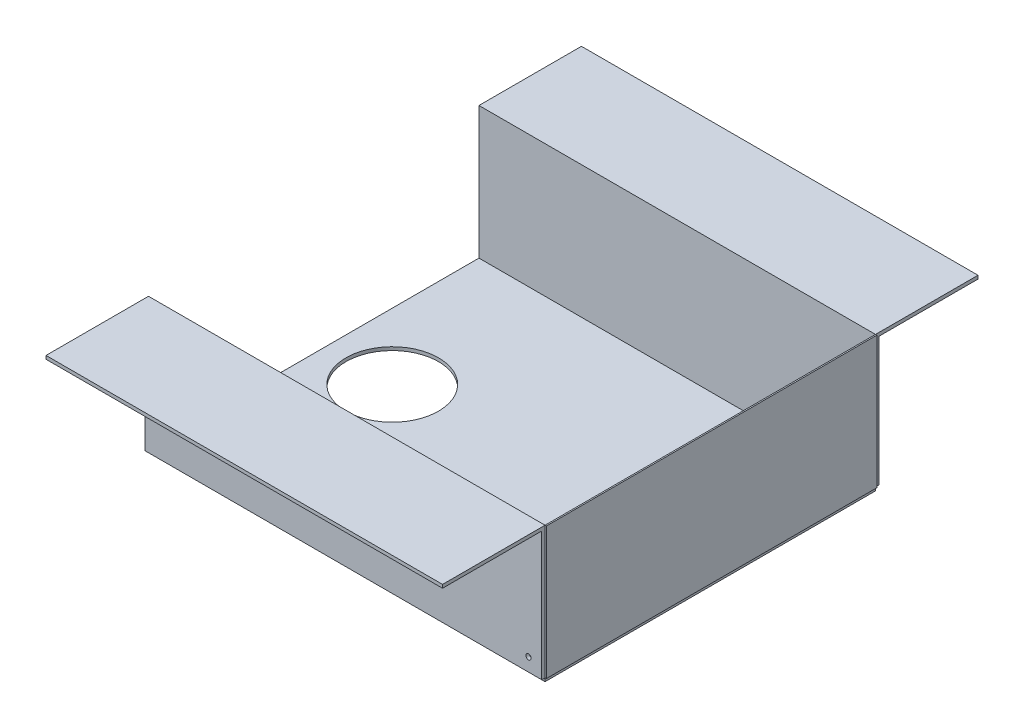
ISO-10303-21;
HEADER;
FILE_DESCRIPTION(('STEP AP214'),'2;1');
FILE_NAME('part.step','',(''),(''),'','','');
FILE_SCHEMA(('AUTOMOTIVE_DESIGN { 1 0 10303 214 1 1 1 1 }'));
ENDSEC;
DATA;
#1=APPLICATION_CONTEXT('core data for automotive mechanical design processes');
#2=APPLICATION_PROTOCOL_DEFINITION('international standard','automotive_design',2000,#1);
#3=PRODUCT_CONTEXT('',#1,'mechanical');
#4=PRODUCT('Part','Part','',(#3));
#5=PRODUCT_RELATED_PRODUCT_CATEGORY('part','',(#4));
#6=PRODUCT_DEFINITION_FORMATION('','',#4);
#7=PRODUCT_DEFINITION_CONTEXT('part definition',#1,'design');
#8=PRODUCT_DEFINITION('design','',#6,#7);
#9=PRODUCT_DEFINITION_SHAPE('','',#8);
#10=(LENGTH_UNIT() NAMED_UNIT(*) SI_UNIT(.MILLI.,.METRE.));
#11=(NAMED_UNIT(*) PLANE_ANGLE_UNIT() SI_UNIT($,.RADIAN.));
#12=(NAMED_UNIT(*) SI_UNIT($,.STERADIAN.) SOLID_ANGLE_UNIT());
#13=UNCERTAINTY_MEASURE_WITH_UNIT(LENGTH_MEASURE(1.E-05),#10,'distance_accuracy_value','');
#14=(GEOMETRIC_REPRESENTATION_CONTEXT(3) GLOBAL_UNCERTAINTY_ASSIGNED_CONTEXT((#13)) GLOBAL_UNIT_ASSIGNED_CONTEXT((#10,
#11,#12)) REPRESENTATION_CONTEXT('',''));
#15=CARTESIAN_POINT('',(0.,0.,0.));
#16=DIRECTION('',(0.,0.,1.));
#17=DIRECTION('',(1.,0.,0.));
#18=AXIS2_PLACEMENT_3D('',#15,#16,#17);
#19=CARTESIAN_POINT('',(163.333270700731,102.54,0.));
#20=DIRECTION('',(0.,1.,0.));
#21=DIRECTION('',(0.,0.,1.));
#22=AXIS2_PLACEMENT_3D('',#19,#20,#21);
#23=PLANE('',#22);
#24=DIRECTION('',(0.,0.,-1.));
#25=VECTOR('',#24,1.);
#26=CARTESIAN_POINT('',(162.333270700731,102.54,0.));
#27=LINE('',#26,#25);
#28=CARTESIAN_POINT('',(162.333270700731,102.54,133.757097239055));
#29=VERTEX_POINT('',#28);
#30=CARTESIAN_POINT('',(162.333270700731,102.54,-116.242902760945));
#31=VERTEX_POINT('',#30);
#32=EDGE_CURVE('E111',#29,#31,#27,.T.);
#33=ORIENTED_EDGE('',*,*,#32,.F.);
#34=DIRECTION('',(-1.,0.,0.));
#35=VECTOR('',#34,1.);
#36=CARTESIAN_POINT('',(163.333270700731,102.54,133.757097239055));
#37=LINE('',#36,#35);
#38=CARTESIAN_POINT('',(163.333270700731,102.54,133.757097239055));
#39=VERTEX_POINT('',#38);
#40=EDGE_CURVE('E12',#39,#29,#37,.T.);
#41=ORIENTED_EDGE('',*,*,#40,.F.);
#42=DIRECTION('',(0.,0.,-1.));
#43=VECTOR('',#42,1.);
#44=CARTESIAN_POINT('',(163.333270700731,102.54,0.));
#45=LINE('',#44,#43);
#46=CARTESIAN_POINT('',(163.333270700731,102.54,-116.242902760945));
#47=VERTEX_POINT('',#46);
#48=EDGE_CURVE('E105',#39,#47,#45,.T.);
#49=ORIENTED_EDGE('',*,*,#48,.T.);
#50=DIRECTION('',(-1.,0.,0.));
#51=VECTOR('',#50,1.);
#52=CARTESIAN_POINT('',(163.333270700731,102.54,-116.242902760945));
#53=LINE('',#52,#51);
#54=EDGE_CURVE('E63',#47,#31,#53,.T.);
#55=ORIENTED_EDGE('',*,*,#54,.T.);
#56=EDGE_LOOP('',(#33,#41,#49,#55));
#57=FACE_BOUND('',#56,.T.);
#58=ADVANCED_FACE('F47',(#57),#23,.T.);
#59=CARTESIAN_POINT('',(163.333270700731,0.,133.757097239055));
#60=DIRECTION('',(0.,0.,1.));
#61=DIRECTION('',(1.,0.,0.));
#62=AXIS2_PLACEMENT_3D('',#59,#60,#61);
#63=PLANE('',#62);
#64=DIRECTION('',(0.,1.,0.));
#65=VECTOR('',#64,1.);
#66=CARTESIAN_POINT('',(162.333270700731,0.,133.757097239055));
#67=LINE('',#66,#65);
#68=CARTESIAN_POINT('',(162.333270700731,2.54,133.757097239055));
#69=VERTEX_POINT('',#68);
#70=EDGE_CURVE('E95',#69,#29,#67,.T.);
#71=ORIENTED_EDGE('',*,*,#70,.F.);
#72=DIRECTION('',(-1.,0.,0.));
#73=VECTOR('',#72,1.);
#74=CARTESIAN_POINT('',(163.333270700731,2.54,133.757097239055));
#75=LINE('',#74,#73);
#76=CARTESIAN_POINT('',(163.333270700731,2.54,133.757097239055));
#77=VERTEX_POINT('',#76);
#78=EDGE_CURVE('E55',#77,#69,#75,.T.);
#79=ORIENTED_EDGE('',*,*,#78,.F.);
#80=DIRECTION('',(0.,1.,0.));
#81=VECTOR('',#80,1.);
#82=CARTESIAN_POINT('',(163.333270700731,0.,133.757097239055));
#83=LINE('',#82,#81);
#84=EDGE_CURVE('E93',#77,#39,#83,.T.);
#85=ORIENTED_EDGE('',*,*,#84,.T.);
#86=ORIENTED_EDGE('',*,*,#40,.T.);
#87=EDGE_LOOP('',(#71,#79,#85,#86));
#88=FACE_BOUND('',#87,.T.);
#89=ADVANCED_FACE('F91',(#88),#63,.T.);
#90=CARTESIAN_POINT('',(163.333270700731,2.54,0.));
#91=DIRECTION('',(0.,1.,0.));
#92=DIRECTION('',(0.,0.,1.));
#93=AXIS2_PLACEMENT_3D('',#90,#91,#92);
#94=PLANE('',#93);
#95=DIRECTION('',(0.,0.,-1.));
#96=VECTOR('',#95,1.);
#97=CARTESIAN_POINT('',(162.333270700731,2.54,0.));
#98=LINE('',#97,#96);
#99=CARTESIAN_POINT('',(162.333270700731,2.54,-116.242902760945));
#100=VERTEX_POINT('',#99);
#101=EDGE_CURVE('E114',#69,#100,#98,.T.);
#102=ORIENTED_EDGE('',*,*,#101,.T.);
#103=DIRECTION('',(-1.,0.,0.));
#104=VECTOR('',#103,1.);
#105=CARTESIAN_POINT('',(163.333270700731,2.54,-116.242902760945));
#106=LINE('',#105,#104);
#107=CARTESIAN_POINT('',(163.333270700731,2.54,-116.242902760945));
#108=VERTEX_POINT('',#107);
#109=EDGE_CURVE('E77',#108,#100,#106,.T.);
#110=ORIENTED_EDGE('',*,*,#109,.F.);
#111=DIRECTION('',(0.,0.,-1.));
#112=VECTOR('',#111,1.);
#113=CARTESIAN_POINT('',(163.333270700731,2.54,0.));
#114=LINE('',#113,#112);
#115=EDGE_CURVE('E98',#77,#108,#114,.T.);
#116=ORIENTED_EDGE('',*,*,#115,.F.);
#117=ORIENTED_EDGE('',*,*,#78,.T.);
#118=EDGE_LOOP('',(#102,#110,#116,#117));
#119=FACE_BOUND('',#118,.T.);
#120=ADVANCED_FACE('F99',(#119),#94,.F.);
#121=CARTESIAN_POINT('',(163.333270700731,0.,-116.242902760945));
#122=DIRECTION('',(0.,0.,-1.));
#123=DIRECTION('',(-1.,0.,0.));
#124=AXIS2_PLACEMENT_3D('',#121,#122,#123);
#125=PLANE('',#124);
#126=DIRECTION('',(0.,-1.,0.));
#127=VECTOR('',#126,1.);
#128=CARTESIAN_POINT('',(162.333270700731,0.,-116.242902760945));
#129=LINE('',#128,#127);
#130=EDGE_CURVE('E107',#31,#100,#129,.T.);
#131=ORIENTED_EDGE('',*,*,#130,.F.);
#132=ORIENTED_EDGE('',*,*,#54,.F.);
#133=DIRECTION('',(0.,-1.,0.));
#134=VECTOR('',#133,1.);
#135=CARTESIAN_POINT('',(163.333270700731,0.,-116.242902760945));
#136=LINE('',#135,#134);
#137=EDGE_CURVE('E102',#47,#108,#136,.T.);
#138=ORIENTED_EDGE('',*,*,#137,.T.);
#139=ORIENTED_EDGE('',*,*,#109,.T.);
#140=EDGE_LOOP('',(#131,#132,#138,#139));
#141=FACE_BOUND('',#140,.T.);
#142=ADVANCED_FACE('F121',(#141),#125,.T.);
#143=CARTESIAN_POINT('',(163.333270700731,0.,0.));
#144=DIRECTION('',(1.,0.,0.));
#145=DIRECTION('',(0.,0.,-1.));
#146=AXIS2_PLACEMENT_3D('',#143,#144,#145);
#147=PLANE('',#146);
#148=ORIENTED_EDGE('',*,*,#48,.F.);
#149=ORIENTED_EDGE('',*,*,#84,.F.);
#150=ORIENTED_EDGE('',*,*,#115,.T.);
#151=ORIENTED_EDGE('',*,*,#137,.F.);
#152=EDGE_LOOP('',(#148,#149,#150,#151));
#153=FACE_BOUND('',#152,.T.);
#154=ADVANCED_FACE('F104',(#153),#147,.T.);
#155=CARTESIAN_POINT('',(162.333270700731,0.,0.));
#156=DIRECTION('',(1.,0.,0.));
#157=DIRECTION('',(0.,0.,-1.));
#158=AXIS2_PLACEMENT_3D('',#155,#156,#157);
#159=PLANE('',#158);
#160=ORIENTED_EDGE('',*,*,#32,.T.);
#161=ORIENTED_EDGE('',*,*,#130,.T.);
#162=ORIENTED_EDGE('',*,*,#101,.F.);
#163=ORIENTED_EDGE('',*,*,#70,.T.);
#164=EDGE_LOOP('',(#160,#161,#162,#163));
#165=FACE_BOUND('',#164,.T.);
#166=ADVANCED_FACE('F120',(#165),#159,.F.);
#167=CLOSED_SHELL('',(#58,#89,#120,#142,#154,#166));
#168=MANIFOLD_SOLID_BREP('B2',#167);
#169=CARTESIAN_POINT('',(162.333270700731,102.54,-118.782902760945));
#170=DIRECTION('',(0.,0.,1.));
#171=DIRECTION('',(1.,0.,0.));
#172=AXIS2_PLACEMENT_3D('',#169,#170,#171);
#173=PLANE('',#172);
#174=CARTESIAN_POINT('',(152.333270700731,12.54,-118.782902760945));
#175=DIRECTION('',(0.,0.,-1.));
#176=DIRECTION('',(-1.,0.,0.));
#177=AXIS2_PLACEMENT_3D('',#174,#175,#176);
#178=CIRCLE('',#177,2.);
#179=CARTESIAN_POINT('',(150.333270700731,12.54,-118.782902760945));
#180=VERTEX_POINT('',#179);
#181=EDGE_CURVE('E293',#180,#180,#178,.T.);
#182=ORIENTED_EDGE('',*,*,#181,.F.);
#183=EDGE_LOOP('',(#182));
#184=FACE_BOUND('',#183,.T.);
#185=DIRECTION('',(-1.,0.,0.));
#186=VECTOR('',#185,1.);
#187=CARTESIAN_POINT('',(162.333270700731,100.,-118.782902760945));
#188=LINE('',#187,#186);
#189=CARTESIAN_POINT('',(162.333270700731,100.,-118.782902760945));
#190=VERTEX_POINT('',#189);
#191=CARTESIAN_POINT('',(-137.666729299269,100.,-118.782902760945));
#192=VERTEX_POINT('',#191);
#193=EDGE_CURVE('E199',#190,#192,#188,.T.);
#194=ORIENTED_EDGE('',*,*,#193,.F.);
#195=DIRECTION('',(0.,-1.,0.));
#196=VECTOR('',#195,1.);
#197=CARTESIAN_POINT('',(162.333270700731,102.54,-118.782902760945));
#198=LINE('',#197,#196);
#199=CARTESIAN_POINT('',(162.333270700731,2.54,-118.782902760945));
#200=VERTEX_POINT('',#199);
#201=EDGE_CURVE('E223',#190,#200,#198,.T.);
#202=ORIENTED_EDGE('',*,*,#201,.T.);
#203=DIRECTION('',(1.,0.,0.));
#204=VECTOR('',#203,1.);
#205=CARTESIAN_POINT('',(162.333270700731,2.54,-118.782902760945));
#206=LINE('',#205,#204);
#207=CARTESIAN_POINT('',(-137.666729299269,2.54,-118.782902760945));
#208=VERTEX_POINT('',#207);
#209=EDGE_CURVE('E225',#200,#208,#206,.F.);
#210=ORIENTED_EDGE('',*,*,#209,.T.);
#211=DIRECTION('',(0.,-1.,0.));
#212=VECTOR('',#211,1.);
#213=CARTESIAN_POINT('',(-137.666729299269,102.54,-118.782902760945));
#214=LINE('',#213,#212);
#215=EDGE_CURVE('E45',#192,#208,#214,.T.);
#216=ORIENTED_EDGE('',*,*,#215,.F.);
#217=EDGE_LOOP('',(#194,#202,#210,#216));
#218=FACE_BOUND('',#217,.T.);
#219=ADVANCED_FACE('F183',(#184,#218),#173,.F.);
#220=CARTESIAN_POINT('',(-137.666729299269,102.54,-116.242902760945));
#221=DIRECTION('',(-1.,0.,0.));
#222=DIRECTION('',(0.,0.,1.));
#223=AXIS2_PLACEMENT_3D('',#220,#221,#222);
#224=PLANE('',#223);
#225=DIRECTION('',(0.,0.,-1.));
#226=VECTOR('',#225,1.);
#227=CARTESIAN_POINT('',(-137.666729299269,2.54,-116.242902760945));
#228=LINE('',#227,#226);
#229=CARTESIAN_POINT('',(-137.666729299269,2.54,-116.242902760945));
#230=VERTEX_POINT('',#229);
#231=EDGE_CURVE('E239',#230,#208,#228,.T.);
#232=ORIENTED_EDGE('',*,*,#231,.F.);
#233=DIRECTION('',(0.,-1.,0.));
#234=VECTOR('',#233,1.);
#235=CARTESIAN_POINT('',(-137.666729299269,102.54,-116.242902760945));
#236=LINE('',#235,#234);
#237=CARTESIAN_POINT('',(-137.666729299269,102.54,-116.242902760945));
#238=VERTEX_POINT('',#237);
#239=EDGE_CURVE('E191',#238,#230,#236,.T.);
#240=ORIENTED_EDGE('',*,*,#239,.F.);
#241=DIRECTION('',(0.,0.,-1.));
#242=VECTOR('',#241,1.);
#243=CARTESIAN_POINT('',(-137.666729299269,102.54,-116.242902760945));
#244=LINE('',#243,#242);
#245=CARTESIAN_POINT('',(-137.666729299269,102.54,-193.782902760945));
#246=VERTEX_POINT('',#245);
#247=EDGE_CURVE('E244',#238,#246,#244,.T.);
#248=ORIENTED_EDGE('',*,*,#247,.T.);
#249=DIRECTION('',(0.,-1.,0.));
#250=VECTOR('',#249,1.);
#251=CARTESIAN_POINT('',(-137.666729299269,102.54,-193.782902760945));
#252=LINE('',#251,#250);
#253=CARTESIAN_POINT('',(-137.666729299269,100.,-193.782902760945));
#254=VERTEX_POINT('',#253);
#255=EDGE_CURVE('E289',#246,#254,#252,.T.);
#256=ORIENTED_EDGE('',*,*,#255,.T.);
#257=DIRECTION('',(0.,0.,1.));
#258=VECTOR('',#257,1.);
#259=CARTESIAN_POINT('',(-137.666729299269,100.,-193.782902760945));
#260=LINE('',#259,#258);
#261=EDGE_CURVE('E240',#254,#192,#260,.T.);
#262=ORIENTED_EDGE('',*,*,#261,.T.);
#263=ORIENTED_EDGE('',*,*,#215,.T.);
#264=EDGE_LOOP('',(#232,#240,#248,#256,#262,#263));
#265=FACE_BOUND('',#264,.T.);
#266=ADVANCED_FACE('F304',(#265),#224,.T.);
#267=CARTESIAN_POINT('',(162.333270700731,102.54,-116.242902760945));
#268=DIRECTION('',(0.,0.,1.));
#269=DIRECTION('',(1.,0.,0.));
#270=AXIS2_PLACEMENT_3D('',#267,#268,#269);
#271=PLANE('',#270);
#272=CARTESIAN_POINT('',(152.333270700731,12.54,-116.242902760945));
#273=DIRECTION('',(0.,0.,1.));
#274=DIRECTION('',(1.,0.,0.));
#275=AXIS2_PLACEMENT_3D('',#272,#273,#274);
#276=CIRCLE('',#275,2.);
#277=CARTESIAN_POINT('',(154.333270700731,12.54,-116.242902760945));
#278=VERTEX_POINT('',#277);
#279=EDGE_CURVE('E186',#278,#278,#276,.T.);
#280=ORIENTED_EDGE('',*,*,#279,.F.);
#281=EDGE_LOOP('',(#280));
#282=FACE_BOUND('',#281,.T.);
#283=DIRECTION('',(-1.,0.,0.));
#284=VECTOR('',#283,1.);
#285=CARTESIAN_POINT('',(162.333270700731,2.54,-116.242902760945));
#286=LINE('',#285,#284);
#287=CARTESIAN_POINT('',(162.333270700731,2.54,-116.242902760945));
#288=VERTEX_POINT('',#287);
#289=EDGE_CURVE('E245',#288,#230,#286,.T.);
#290=ORIENTED_EDGE('',*,*,#289,.F.);
#291=DIRECTION('',(0.,-1.,0.));
#292=VECTOR('',#291,1.);
#293=CARTESIAN_POINT('',(162.333270700731,102.54,-116.242902760945));
#294=LINE('',#293,#292);
#295=CARTESIAN_POINT('',(162.333270700731,102.54,-116.242902760945));
#296=VERTEX_POINT('',#295);
#297=EDGE_CURVE('E208',#296,#288,#294,.T.);
#298=ORIENTED_EDGE('',*,*,#297,.F.);
#299=DIRECTION('',(-1.,0.,0.));
#300=VECTOR('',#299,1.);
#301=CARTESIAN_POINT('',(162.333270700731,102.54,-116.242902760945));
#302=LINE('',#301,#300);
#303=EDGE_CURVE('E248',#296,#238,#302,.T.);
#304=ORIENTED_EDGE('',*,*,#303,.T.);
#305=ORIENTED_EDGE('',*,*,#239,.T.);
#306=EDGE_LOOP('',(#290,#298,#304,#305));
#307=FACE_BOUND('',#306,.T.);
#308=ADVANCED_FACE('F302',(#282,#307),#271,.T.);
#309=CARTESIAN_POINT('',(162.333270700731,102.54,-118.782902760945));
#310=DIRECTION('',(1.,0.,0.));
#311=DIRECTION('',(0.,0.,-1.));
#312=AXIS2_PLACEMENT_3D('',#309,#310,#311);
#313=PLANE('',#312);
#314=DIRECTION('',(0.,0.,1.));
#315=VECTOR('',#314,1.);
#316=CARTESIAN_POINT('',(162.333270700731,2.54,-118.782902760945));
#317=LINE('',#316,#315);
#318=EDGE_CURVE('E237',#200,#288,#317,.T.);
#319=ORIENTED_EDGE('',*,*,#318,.F.);
#320=ORIENTED_EDGE('',*,*,#201,.F.);
#321=DIRECTION('',(0.,0.,1.));
#322=VECTOR('',#321,1.);
#323=CARTESIAN_POINT('',(162.333270700731,100.,-193.782902760945));
#324=LINE('',#323,#322);
#325=CARTESIAN_POINT('',(162.333270700731,100.,-193.782902760945));
#326=VERTEX_POINT('',#325);
#327=EDGE_CURVE('E260',#326,#190,#324,.T.);
#328=ORIENTED_EDGE('',*,*,#327,.F.);
#329=DIRECTION('',(0.,1.,0.));
#330=VECTOR('',#329,1.);
#331=CARTESIAN_POINT('',(162.333270700731,100.,-193.782902760945));
#332=LINE('',#331,#330);
#333=CARTESIAN_POINT('',(162.333270700731,102.54,-193.782902760945));
#334=VERTEX_POINT('',#333);
#335=EDGE_CURVE('E268',#326,#334,#332,.T.);
#336=ORIENTED_EDGE('',*,*,#335,.T.);
#337=DIRECTION('',(0.,0.,1.));
#338=VECTOR('',#337,1.);
#339=CARTESIAN_POINT('',(162.333270700731,102.54,-118.782902760945));
#340=LINE('',#339,#338);
#341=EDGE_CURVE('E231',#334,#296,#340,.T.);
#342=ORIENTED_EDGE('',*,*,#341,.T.);
#343=ORIENTED_EDGE('',*,*,#297,.T.);
#344=EDGE_LOOP('',(#319,#320,#328,#336,#342,#343));
#345=FACE_BOUND('',#344,.T.);
#346=ADVANCED_FACE('F242',(#345),#313,.T.);
#347=CARTESIAN_POINT('',(0.,102.54,0.));
#348=DIRECTION('',(0.,1.,0.));
#349=DIRECTION('',(1.,0.,0.));
#350=AXIS2_PLACEMENT_3D('',#347,#348,#349);
#351=PLANE('',#350);
#352=ORIENTED_EDGE('',*,*,#341,.F.);
#353=DIRECTION('',(-1.,0.,0.));
#354=VECTOR('',#353,1.);
#355=CARTESIAN_POINT('',(162.333270700731,102.54,-193.782902760945));
#356=LINE('',#355,#354);
#357=EDGE_CURVE('E282',#334,#246,#356,.T.);
#358=ORIENTED_EDGE('',*,*,#357,.T.);
#359=ORIENTED_EDGE('',*,*,#247,.F.);
#360=ORIENTED_EDGE('',*,*,#303,.F.);
#361=EDGE_LOOP('',(#352,#358,#359,#360));
#362=FACE_BOUND('',#361,.T.);
#363=ADVANCED_FACE('F279',(#362),#351,.T.);
#364=CARTESIAN_POINT('',(0.,2.54,0.));
#365=DIRECTION('',(0.,1.,0.));
#366=DIRECTION('',(1.,0.,0.));
#367=AXIS2_PLACEMENT_3D('',#364,#365,#366);
#368=PLANE('',#367);
#369=ORIENTED_EDGE('',*,*,#209,.F.);
#370=ORIENTED_EDGE('',*,*,#318,.T.);
#371=ORIENTED_EDGE('',*,*,#289,.T.);
#372=ORIENTED_EDGE('',*,*,#231,.T.);
#373=EDGE_LOOP('',(#369,#370,#371,#372));
#374=FACE_BOUND('',#373,.T.);
#375=ADVANCED_FACE('F235',(#374),#368,.F.);
#376=CARTESIAN_POINT('',(162.333270700731,100.,-193.782902760945));
#377=DIRECTION('',(0.,1.,0.));
#378=DIRECTION('',(0.,0.,1.));
#379=AXIS2_PLACEMENT_3D('',#376,#377,#378);
#380=PLANE('',#379);
#381=ORIENTED_EDGE('',*,*,#193,.T.);
#382=ORIENTED_EDGE('',*,*,#261,.F.);
#383=DIRECTION('',(-1.,0.,0.));
#384=VECTOR('',#383,1.);
#385=CARTESIAN_POINT('',(162.333270700731,100.,-193.782902760945));
#386=LINE('',#385,#384);
#387=EDGE_CURVE('E265',#326,#254,#386,.T.);
#388=ORIENTED_EDGE('',*,*,#387,.F.);
#389=ORIENTED_EDGE('',*,*,#327,.T.);
#390=EDGE_LOOP('',(#381,#382,#388,#389));
#391=FACE_BOUND('',#390,.T.);
#392=ADVANCED_FACE('F315',(#391),#380,.F.);
#393=CARTESIAN_POINT('',(0.,0.,-193.782902760945));
#394=DIRECTION('',(0.,0.,1.));
#395=DIRECTION('',(1.,0.,0.));
#396=AXIS2_PLACEMENT_3D('',#393,#394,#395);
#397=PLANE('',#396);
#398=ORIENTED_EDGE('',*,*,#387,.T.);
#399=ORIENTED_EDGE('',*,*,#255,.F.);
#400=ORIENTED_EDGE('',*,*,#357,.F.);
#401=ORIENTED_EDGE('',*,*,#335,.F.);
#402=EDGE_LOOP('',(#398,#399,#400,#401));
#403=FACE_BOUND('',#402,.T.);
#404=ADVANCED_FACE('F287',(#403),#397,.F.);
#405=CARTESIAN_POINT('',(152.333270700731,12.54,211.297122239054));
#406=DIRECTION('',(0.,0.,-1.));
#407=DIRECTION('',(-1.,0.,0.));
#408=AXIS2_PLACEMENT_3D('',#405,#406,#407);
#409=CYLINDRICAL_SURFACE('',#408,2.);
#410=ORIENTED_EDGE('',*,*,#279,.T.);
#411=EDGE_LOOP('',(#410));
#412=FACE_BOUND('',#411,.T.);
#413=ORIENTED_EDGE('',*,*,#181,.T.);
#414=EDGE_LOOP('',(#413));
#415=FACE_BOUND('',#414,.T.);
#416=ADVANCED_FACE('F300',(#412,#415),#409,.F.);
#417=CLOSED_SHELL('',(#219,#266,#308,#346,#363,#375,#392,#404,#416));
#418=MANIFOLD_SOLID_BREP('B6',#417);
#419=CARTESIAN_POINT('',(-137.666729299269,102.54,136.297097239054));
#420=DIRECTION('',(0.,0.,-1.));
#421=DIRECTION('',(-1.,0.,0.));
#422=AXIS2_PLACEMENT_3D('',#419,#420,#421);
#423=PLANE('',#422);
#424=CARTESIAN_POINT('',(152.333270700731,12.54,136.297097239054));
#425=DIRECTION('',(0.,0.,-1.));
#426=DIRECTION('',(-1.,0.,0.));
#427=AXIS2_PLACEMENT_3D('',#424,#425,#426);
#428=CIRCLE('',#427,2.);
#429=CARTESIAN_POINT('',(150.333270700731,12.54,136.297097239054));
#430=VERTEX_POINT('',#429);
#431=EDGE_CURVE('E490',#430,#430,#428,.T.);
#432=ORIENTED_EDGE('',*,*,#431,.T.);
#433=EDGE_LOOP('',(#432));
#434=FACE_BOUND('',#433,.T.);
#435=DIRECTION('',(1.,0.,0.));
#436=VECTOR('',#435,1.);
#437=CARTESIAN_POINT('',(-137.666729299269,100.,136.297097239054));
#438=LINE('',#437,#436);
#439=CARTESIAN_POINT('',(-137.666729299269,100.,136.297097239054));
#440=VERTEX_POINT('',#439);
#441=CARTESIAN_POINT('',(162.333270700731,100.,136.297097239054));
#442=VERTEX_POINT('',#441);
#443=EDGE_CURVE('E423',#440,#442,#438,.T.);
#444=ORIENTED_EDGE('',*,*,#443,.F.);
#445=DIRECTION('',(0.,-1.,0.));
#446=VECTOR('',#445,1.);
#447=CARTESIAN_POINT('',(-137.666729299269,102.54,136.297097239054));
#448=LINE('',#447,#446);
#449=CARTESIAN_POINT('',(-137.666729299269,2.54,136.297097239054));
#450=VERTEX_POINT('',#449);
#451=EDGE_CURVE('E447',#440,#450,#448,.T.);
#452=ORIENTED_EDGE('',*,*,#451,.T.);
#453=DIRECTION('',(1.,0.,0.));
#454=VECTOR('',#453,1.);
#455=CARTESIAN_POINT('',(-137.666729299269,2.54,136.297097239054));
#456=LINE('',#455,#454);
#457=CARTESIAN_POINT('',(162.333270700731,2.54,136.297097239054));
#458=VERTEX_POINT('',#457);
#459=EDGE_CURVE('E449',#450,#458,#456,.T.);
#460=ORIENTED_EDGE('',*,*,#459,.T.);
#461=DIRECTION('',(0.,-1.,0.));
#462=VECTOR('',#461,1.);
#463=CARTESIAN_POINT('',(162.333270700731,102.54,136.297097239054));
#464=LINE('',#463,#462);
#465=EDGE_CURVE('E181',#442,#458,#464,.T.);
#466=ORIENTED_EDGE('',*,*,#465,.F.);
#467=EDGE_LOOP('',(#444,#452,#460,#466));
#468=FACE_BOUND('',#467,.T.);
#469=ADVANCED_FACE('F407',(#434,#468),#423,.F.);
#470=CARTESIAN_POINT('',(162.333270700731,102.54,133.757097239055));
#471=DIRECTION('',(1.,0.,0.));
#472=DIRECTION('',(0.,0.,-1.));
#473=AXIS2_PLACEMENT_3D('',#470,#471,#472);
#474=PLANE('',#473);
#475=DIRECTION('',(0.,0.,1.));
#476=VECTOR('',#475,1.);
#477=CARTESIAN_POINT('',(162.333270700731,2.54,133.757097239055));
#478=LINE('',#477,#476);
#479=CARTESIAN_POINT('',(162.333270700731,2.54,133.757097239055));
#480=VERTEX_POINT('',#479);
#481=EDGE_CURVE('E463',#480,#458,#478,.T.);
#482=ORIENTED_EDGE('',*,*,#481,.F.);
#483=DIRECTION('',(0.,-1.,0.));
#484=VECTOR('',#483,1.);
#485=CARTESIAN_POINT('',(162.333270700731,102.54,133.757097239055));
#486=LINE('',#485,#484);
#487=CARTESIAN_POINT('',(162.333270700731,102.54,133.757097239055));
#488=VERTEX_POINT('',#487);
#489=EDGE_CURVE('E415',#488,#480,#486,.T.);
#490=ORIENTED_EDGE('',*,*,#489,.F.);
#491=DIRECTION('',(0.,0.,1.));
#492=VECTOR('',#491,1.);
#493=CARTESIAN_POINT('',(162.333270700731,102.54,133.757097239055));
#494=LINE('',#493,#492);
#495=CARTESIAN_POINT('',(162.333270700731,102.54,211.297097239054));
#496=VERTEX_POINT('',#495);
#497=EDGE_CURVE('E468',#488,#496,#494,.T.);
#498=ORIENTED_EDGE('',*,*,#497,.T.);
#499=DIRECTION('',(0.,-1.,0.));
#500=VECTOR('',#499,1.);
#501=CARTESIAN_POINT('',(162.333270700731,102.54,211.297097239054));
#502=LINE('',#501,#500);
#503=CARTESIAN_POINT('',(162.333270700731,100.,211.297097239054));
#504=VERTEX_POINT('',#503);
#505=EDGE_CURVE('E514',#496,#504,#502,.T.);
#506=ORIENTED_EDGE('',*,*,#505,.T.);
#507=DIRECTION('',(0.,0.,-1.));
#508=VECTOR('',#507,1.);
#509=CARTESIAN_POINT('',(162.333270700731,100.,211.297097239054));
#510=LINE('',#509,#508);
#511=EDGE_CURVE('E464',#504,#442,#510,.T.);
#512=ORIENTED_EDGE('',*,*,#511,.T.);
#513=ORIENTED_EDGE('',*,*,#465,.T.);
#514=EDGE_LOOP('',(#482,#490,#498,#506,#512,#513));
#515=FACE_BOUND('',#514,.T.);
#516=ADVANCED_FACE('F529',(#515),#474,.T.);
#517=CARTESIAN_POINT('',(-137.666729299269,102.54,133.757097239055));
#518=DIRECTION('',(0.,0.,-1.));
#519=DIRECTION('',(-1.,0.,0.));
#520=AXIS2_PLACEMENT_3D('',#517,#518,#519);
#521=PLANE('',#520);
#522=CARTESIAN_POINT('',(152.333270700731,12.54,133.757097239055));
#523=DIRECTION('',(0.,0.,-1.));
#524=DIRECTION('',(-1.,0.,0.));
#525=AXIS2_PLACEMENT_3D('',#522,#523,#524);
#526=CIRCLE('',#525,2.);
#527=CARTESIAN_POINT('',(150.333270700731,12.54,133.757097239055));
#528=VERTEX_POINT('',#527);
#529=EDGE_CURVE('E410',#528,#528,#526,.T.);
#530=ORIENTED_EDGE('',*,*,#529,.F.);
#531=EDGE_LOOP('',(#530));
#532=FACE_BOUND('',#531,.T.);
#533=DIRECTION('',(1.,0.,0.));
#534=VECTOR('',#533,1.);
#535=CARTESIAN_POINT('',(-137.666729299269,2.54,133.757097239055));
#536=LINE('',#535,#534);
#537=CARTESIAN_POINT('',(-137.666729299269,2.54,133.757097239055));
#538=VERTEX_POINT('',#537);
#539=EDGE_CURVE('E469',#538,#480,#536,.T.);
#540=ORIENTED_EDGE('',*,*,#539,.F.);
#541=DIRECTION('',(0.,-1.,0.));
#542=VECTOR('',#541,1.);
#543=CARTESIAN_POINT('',(-137.666729299269,102.54,133.757097239055));
#544=LINE('',#543,#542);
#545=CARTESIAN_POINT('',(-137.666729299269,102.54,133.757097239055));
#546=VERTEX_POINT('',#545);
#547=EDGE_CURVE('E432',#546,#538,#544,.T.);
#548=ORIENTED_EDGE('',*,*,#547,.F.);
#549=DIRECTION('',(1.,0.,0.));
#550=VECTOR('',#549,1.);
#551=CARTESIAN_POINT('',(-137.666729299269,102.54,133.757097239055));
#552=LINE('',#551,#550);
#553=EDGE_CURVE('E472',#546,#488,#552,.T.);
#554=ORIENTED_EDGE('',*,*,#553,.T.);
#555=ORIENTED_EDGE('',*,*,#489,.T.);
#556=EDGE_LOOP('',(#540,#548,#554,#555));
#557=FACE_BOUND('',#556,.T.);
#558=ADVANCED_FACE('F527',(#532,#557),#521,.T.);
#559=CARTESIAN_POINT('',(-137.666729299269,102.54,136.297097239054));
#560=DIRECTION('',(-1.,0.,0.));
#561=DIRECTION('',(0.,0.,1.));
#562=AXIS2_PLACEMENT_3D('',#559,#560,#561);
#563=PLANE('',#562);
#564=DIRECTION('',(0.,0.,-1.));
#565=VECTOR('',#564,1.);
#566=CARTESIAN_POINT('',(-137.666729299269,2.54,136.297097239054));
#567=LINE('',#566,#565);
#568=EDGE_CURVE('E461',#450,#538,#567,.T.);
#569=ORIENTED_EDGE('',*,*,#568,.F.);
#570=ORIENTED_EDGE('',*,*,#451,.F.);
#571=DIRECTION('',(0.,0.,-1.));
#572=VECTOR('',#571,1.);
#573=CARTESIAN_POINT('',(-137.666729299269,100.,211.297097239054));
#574=LINE('',#573,#572);
#575=CARTESIAN_POINT('',(-137.666729299269,100.,211.297097239054));
#576=VERTEX_POINT('',#575);
#577=EDGE_CURVE('E484',#576,#440,#574,.T.);
#578=ORIENTED_EDGE('',*,*,#577,.F.);
#579=DIRECTION('',(0.,1.,0.));
#580=VECTOR('',#579,1.);
#581=CARTESIAN_POINT('',(-137.666729299269,100.,211.297097239054));
#582=LINE('',#581,#580);
#583=CARTESIAN_POINT('',(-137.666729299269,102.54,211.297097239054));
#584=VERTEX_POINT('',#583);
#585=EDGE_CURVE('E493',#576,#584,#582,.T.);
#586=ORIENTED_EDGE('',*,*,#585,.T.);
#587=DIRECTION('',(0.,0.,-1.));
#588=VECTOR('',#587,1.);
#589=CARTESIAN_POINT('',(-137.666729299269,102.54,136.297097239054));
#590=LINE('',#589,#588);
#591=EDGE_CURVE('E455',#584,#546,#590,.T.);
#592=ORIENTED_EDGE('',*,*,#591,.T.);
#593=ORIENTED_EDGE('',*,*,#547,.T.);
#594=EDGE_LOOP('',(#569,#570,#578,#586,#592,#593));
#595=FACE_BOUND('',#594,.T.);
#596=ADVANCED_FACE('F466',(#595),#563,.T.);
#597=CARTESIAN_POINT('',(0.,102.54,0.));
#598=DIRECTION('',(0.,-1.,0.));
#599=DIRECTION('',(-1.,0.,0.));
#600=AXIS2_PLACEMENT_3D('',#597,#598,#599);
#601=PLANE('',#600);
#602=ORIENTED_EDGE('',*,*,#591,.F.);
#603=DIRECTION('',(1.,0.,0.));
#604=VECTOR('',#603,1.);
#605=CARTESIAN_POINT('',(-137.666729299269,102.54,211.297097239054));
#606=LINE('',#605,#604);
#607=EDGE_CURVE('E507',#584,#496,#606,.T.);
#608=ORIENTED_EDGE('',*,*,#607,.T.);
#609=ORIENTED_EDGE('',*,*,#497,.F.);
#610=ORIENTED_EDGE('',*,*,#553,.F.);
#611=EDGE_LOOP('',(#602,#608,#609,#610));
#612=FACE_BOUND('',#611,.T.);
#613=ADVANCED_FACE('F504',(#612),#601,.F.);
#614=CARTESIAN_POINT('',(0.,2.54,0.));
#615=DIRECTION('',(0.,-1.,0.));
#616=DIRECTION('',(-1.,0.,0.));
#617=AXIS2_PLACEMENT_3D('',#614,#615,#616);
#618=PLANE('',#617);
#619=ORIENTED_EDGE('',*,*,#459,.F.);
#620=ORIENTED_EDGE('',*,*,#568,.T.);
#621=ORIENTED_EDGE('',*,*,#539,.T.);
#622=ORIENTED_EDGE('',*,*,#481,.T.);
#623=EDGE_LOOP('',(#619,#620,#621,#622));
#624=FACE_BOUND('',#623,.T.);
#625=ADVANCED_FACE('F459',(#624),#618,.T.);
#626=CARTESIAN_POINT('',(-137.666729299269,100.,211.297097239054));
#627=DIRECTION('',(0.,1.,0.));
#628=DIRECTION('',(0.,0.,1.));
#629=AXIS2_PLACEMENT_3D('',#626,#627,#628);
#630=PLANE('',#629);
#631=ORIENTED_EDGE('',*,*,#443,.T.);
#632=ORIENTED_EDGE('',*,*,#511,.F.);
#633=DIRECTION('',(1.,0.,0.));
#634=VECTOR('',#633,1.);
#635=CARTESIAN_POINT('',(-137.666729299269,100.,211.297097239054));
#636=LINE('',#635,#634);
#637=EDGE_CURVE('E489',#576,#504,#636,.T.);
#638=ORIENTED_EDGE('',*,*,#637,.F.);
#639=ORIENTED_EDGE('',*,*,#577,.T.);
#640=EDGE_LOOP('',(#631,#632,#638,#639));
#641=FACE_BOUND('',#640,.T.);
#642=ADVANCED_FACE('F540',(#641),#630,.F.);
#643=CARTESIAN_POINT('',(0.,0.,211.297097239054));
#644=DIRECTION('',(0.,0.,-1.));
#645=DIRECTION('',(-1.,0.,0.));
#646=AXIS2_PLACEMENT_3D('',#643,#644,#645);
#647=PLANE('',#646);
#648=ORIENTED_EDGE('',*,*,#637,.T.);
#649=ORIENTED_EDGE('',*,*,#505,.F.);
#650=ORIENTED_EDGE('',*,*,#607,.F.);
#651=ORIENTED_EDGE('',*,*,#585,.F.);
#652=EDGE_LOOP('',(#648,#649,#650,#651));
#653=FACE_BOUND('',#652,.T.);
#654=ADVANCED_FACE('F512',(#653),#647,.F.);
#655=CARTESIAN_POINT('',(152.333270700731,12.54,211.297122239054));
#656=DIRECTION('',(0.,0.,-1.));
#657=DIRECTION('',(-1.,0.,0.));
#658=AXIS2_PLACEMENT_3D('',#655,#656,#657);
#659=CYLINDRICAL_SURFACE('',#658,2.);
#660=ORIENTED_EDGE('',*,*,#529,.T.);
#661=EDGE_LOOP('',(#660));
#662=FACE_BOUND('',#661,.T.);
#663=ORIENTED_EDGE('',*,*,#431,.F.);
#664=EDGE_LOOP('',(#663));
#665=FACE_BOUND('',#664,.T.);
#666=ADVANCED_FACE('F524',(#662,#665),#659,.F.);
#667=CLOSED_SHELL('',(#469,#516,#558,#596,#613,#625,#642,#654,#666));
#668=MANIFOLD_SOLID_BREP('B39',#667);
#669=CARTESIAN_POINT('',(-137.666729299269,2.54,-116.242902760945));
#670=DIRECTION('',(1.,0.,0.));
#671=DIRECTION('',(0.,0.,-1.));
#672=AXIS2_PLACEMENT_3D('',#669,#670,#671);
#673=PLANE('',#672);
#674=DIRECTION('',(0.,0.,1.));
#675=VECTOR('',#674,1.);
#676=CARTESIAN_POINT('',(-137.666729299269,0.,-116.242902760945));
#677=LINE('',#676,#675);
#678=CARTESIAN_POINT('',(-137.666729299269,0.,-116.242902760945));
#679=VERTEX_POINT('',#678);
#680=CARTESIAN_POINT('',(-137.666729299269,0.,133.757097239055));
#681=VERTEX_POINT('',#680);
#682=EDGE_CURVE('E685',#679,#681,#677,.T.);
#683=ORIENTED_EDGE('',*,*,#682,.T.);
#684=DIRECTION('',(0.,-1.,0.));
#685=VECTOR('',#684,1.);
#686=CARTESIAN_POINT('',(-137.666729299269,2.54,133.757097239055));
#687=LINE('',#686,#685);
#688=CARTESIAN_POINT('',(-137.666729299269,2.54,133.757097239055));
#689=VERTEX_POINT('',#688);
#690=EDGE_CURVE('E405',#689,#681,#687,.T.);
#691=ORIENTED_EDGE('',*,*,#690,.F.);
#692=DIRECTION('',(0.,0.,1.));
#693=VECTOR('',#692,1.);
#694=CARTESIAN_POINT('',(-137.666729299269,2.54,-116.242902760945));
#695=LINE('',#694,#693);
#696=CARTESIAN_POINT('',(-137.666729299269,2.54,-116.242902760945));
#697=VERTEX_POINT('',#696);
#698=EDGE_CURVE('E673',#697,#689,#695,.T.);
#699=ORIENTED_EDGE('',*,*,#698,.F.);
#700=DIRECTION('',(0.,-1.,0.));
#701=VECTOR('',#700,1.);
#702=CARTESIAN_POINT('',(-137.666729299269,2.54,-116.242902760945));
#703=LINE('',#702,#701);
#704=EDGE_CURVE('E681',#697,#679,#703,.T.);
#705=ORIENTED_EDGE('',*,*,#704,.T.);
#706=EDGE_LOOP('',(#683,#691,#699,#705));
#707=FACE_BOUND('',#706,.T.);
#708=ADVANCED_FACE('F622',(#707),#673,.F.);
#709=CARTESIAN_POINT('',(-137.666729299269,2.54,133.757097239055));
#710=DIRECTION('',(0.,0.,-1.));
#711=DIRECTION('',(-1.,0.,0.));
#712=AXIS2_PLACEMENT_3D('',#709,#710,#711);
#713=PLANE('',#712);
#714=DIRECTION('',(1.,0.,0.));
#715=VECTOR('',#714,1.);
#716=CARTESIAN_POINT('',(-137.666729299269,0.,133.757097239055));
#717=LINE('',#716,#715);
#718=CARTESIAN_POINT('',(162.333270700731,0.,133.757097239055));
#719=VERTEX_POINT('',#718);
#720=EDGE_CURVE('E677',#681,#719,#717,.T.);
#721=ORIENTED_EDGE('',*,*,#720,.T.);
#722=DIRECTION('',(0.,-1.,0.));
#723=VECTOR('',#722,1.);
#724=CARTESIAN_POINT('',(162.333270700731,2.54,133.757097239055));
#725=LINE('',#724,#723);
#726=CARTESIAN_POINT('',(162.333270700731,2.54,133.757097239055));
#727=VERTEX_POINT('',#726);
#728=EDGE_CURVE('E630',#727,#719,#725,.T.);
#729=ORIENTED_EDGE('',*,*,#728,.F.);
#730=DIRECTION('',(1.,0.,0.));
#731=VECTOR('',#730,1.);
#732=CARTESIAN_POINT('',(-137.666729299269,2.54,133.757097239055));
#733=LINE('',#732,#731);
#734=EDGE_CURVE('E668',#689,#727,#733,.T.);
#735=ORIENTED_EDGE('',*,*,#734,.F.);
#736=ORIENTED_EDGE('',*,*,#690,.T.);
#737=EDGE_LOOP('',(#721,#729,#735,#736));
#738=FACE_BOUND('',#737,.T.);
#739=ADVANCED_FACE('F676',(#738),#713,.F.);
#740=CARTESIAN_POINT('',(162.333270700731,2.54,-116.242902760945));
#741=DIRECTION('',(-1.,0.,0.));
#742=DIRECTION('',(0.,0.,1.));
#743=AXIS2_PLACEMENT_3D('',#740,#741,#742);
#744=PLANE('',#743);
#745=DIRECTION('',(0.,0.,-1.));
#746=VECTOR('',#745,1.);
#747=CARTESIAN_POINT('',(162.333270700731,0.,-116.242902760945));
#748=LINE('',#747,#746);
#749=CARTESIAN_POINT('',(162.333270700731,0.,-116.242902760945));
#750=VERTEX_POINT('',#749);
#751=EDGE_CURVE('E655',#719,#750,#748,.T.);
#752=ORIENTED_EDGE('',*,*,#751,.T.);
#753=DIRECTION('',(0.,-1.,0.));
#754=VECTOR('',#753,1.);
#755=CARTESIAN_POINT('',(162.333270700731,2.54,-116.242902760945));
#756=LINE('',#755,#754);
#757=CARTESIAN_POINT('',(162.333270700731,2.54,-116.242902760945));
#758=VERTEX_POINT('',#757);
#759=EDGE_CURVE('E678',#758,#750,#756,.T.);
#760=ORIENTED_EDGE('',*,*,#759,.F.);
#761=DIRECTION('',(0.,0.,-1.));
#762=VECTOR('',#761,1.);
#763=CARTESIAN_POINT('',(162.333270700731,2.54,-116.242902760945));
#764=LINE('',#763,#762);
#765=EDGE_CURVE('E671',#727,#758,#764,.T.);
#766=ORIENTED_EDGE('',*,*,#765,.F.);
#767=ORIENTED_EDGE('',*,*,#728,.T.);
#768=EDGE_LOOP('',(#752,#760,#766,#767));
#769=FACE_BOUND('',#768,.T.);
#770=ADVANCED_FACE('F679',(#769),#744,.F.);
#771=CARTESIAN_POINT('',(-137.666729299269,2.54,-116.242902760945));
#772=DIRECTION('',(0.,0.,1.));
#773=DIRECTION('',(1.,0.,0.));
#774=AXIS2_PLACEMENT_3D('',#771,#772,#773);
#775=PLANE('',#774);
#776=DIRECTION('',(-1.,0.,0.));
#777=VECTOR('',#776,1.);
#778=CARTESIAN_POINT('',(-137.666729299269,0.,-116.242902760945));
#779=LINE('',#778,#777);
#780=EDGE_CURVE('E661',#750,#679,#779,.T.);
#781=ORIENTED_EDGE('',*,*,#780,.T.);
#782=ORIENTED_EDGE('',*,*,#704,.F.);
#783=DIRECTION('',(-1.,0.,0.));
#784=VECTOR('',#783,1.);
#785=CARTESIAN_POINT('',(-137.666729299269,2.54,-116.242902760945));
#786=LINE('',#785,#784);
#787=EDGE_CURVE('E638',#758,#697,#786,.T.);
#788=ORIENTED_EDGE('',*,*,#787,.F.);
#789=ORIENTED_EDGE('',*,*,#759,.T.);
#790=EDGE_LOOP('',(#781,#782,#788,#789));
#791=FACE_BOUND('',#790,.T.);
#792=ADVANCED_FACE('F693',(#791),#775,.F.);
#793=CARTESIAN_POINT('',(0.,2.54,0.));
#794=DIRECTION('',(0.,1.,0.));
#795=DIRECTION('',(0.,0.,1.));
#796=AXIS2_PLACEMENT_3D('',#793,#794,#795);
#797=PLANE('',#796);
#798=CARTESIAN_POINT('',(-87.6667292992691,2.54,-0.653182349788499));
#799=DIRECTION('',(0.,1.,0.));
#800=DIRECTION('',(0.,0.,1.));
#801=AXIS2_PLACEMENT_3D('',#798,#799,#800);
#802=CIRCLE('',#801,35.);
#803=CARTESIAN_POINT('',(-87.6667292992691,2.54,34.3468176502115));
#804=VERTEX_POINT('',#803);
#805=EDGE_CURVE('E688',#804,#804,#802,.T.);
#806=ORIENTED_EDGE('',*,*,#805,.F.);
#807=EDGE_LOOP('',(#806));
#808=FACE_BOUND('',#807,.T.);
#809=ORIENTED_EDGE('',*,*,#698,.T.);
#810=ORIENTED_EDGE('',*,*,#734,.T.);
#811=ORIENTED_EDGE('',*,*,#765,.T.);
#812=ORIENTED_EDGE('',*,*,#787,.T.);
#813=EDGE_LOOP('',(#809,#810,#811,#812));
#814=FACE_BOUND('',#813,.T.);
#815=ADVANCED_FACE('F669',(#808,#814),#797,.T.);
#816=CARTESIAN_POINT('',(0.,0.,0.));
#817=DIRECTION('',(0.,1.,0.));
#818=DIRECTION('',(0.,0.,1.));
#819=AXIS2_PLACEMENT_3D('',#816,#817,#818);
#820=PLANE('',#819);
#821=CARTESIAN_POINT('',(-87.6667292992691,0.,-0.653182349788499));
#822=DIRECTION('',(0.,1.,0.));
#823=DIRECTION('',(0.,0.,1.));
#824=AXIS2_PLACEMENT_3D('',#821,#822,#823);
#825=CIRCLE('',#824,35.);
#826=CARTESIAN_POINT('',(-87.6667292992691,0.,34.3468176502115));
#827=VERTEX_POINT('',#826);
#828=EDGE_CURVE('E701',#827,#827,#825,.T.);
#829=ORIENTED_EDGE('',*,*,#828,.T.);
#830=EDGE_LOOP('',(#829));
#831=FACE_BOUND('',#830,.T.);
#832=ORIENTED_EDGE('',*,*,#682,.F.);
#833=ORIENTED_EDGE('',*,*,#780,.F.);
#834=ORIENTED_EDGE('',*,*,#751,.F.);
#835=ORIENTED_EDGE('',*,*,#720,.F.);
#836=EDGE_LOOP('',(#832,#833,#834,#835));
#837=FACE_BOUND('',#836,.T.);
#838=ADVANCED_FACE('F696',(#831,#837),#820,.F.);
#839=CARTESIAN_POINT('',(-87.6667292992691,0.,-0.653182349788499));
#840=DIRECTION('',(0.,1.,0.));
#841=DIRECTION('',(0.,0.,1.));
#842=AXIS2_PLACEMENT_3D('',#839,#840,#841);
#843=CYLINDRICAL_SURFACE('',#842,35.);
#844=ORIENTED_EDGE('',*,*,#805,.T.);
#845=EDGE_LOOP('',(#844));
#846=FACE_BOUND('',#845,.T.);
#847=ORIENTED_EDGE('',*,*,#828,.F.);
#848=EDGE_LOOP('',(#847));
#849=FACE_BOUND('',#848,.T.);
#850=ADVANCED_FACE('F706',(#846,#849),#843,.F.);
#851=CLOSED_SHELL('',(#708,#739,#770,#792,#815,#838,#850));
#852=MANIFOLD_SOLID_BREP('B175',#851);
#853=ADVANCED_BREP_SHAPE_REPRESENTATION('',(#18,#168,#418,#668,#852),#14);
#854=SHAPE_DEFINITION_REPRESENTATION(#9,#853);
ENDSEC;
END-ISO-10303-21;
